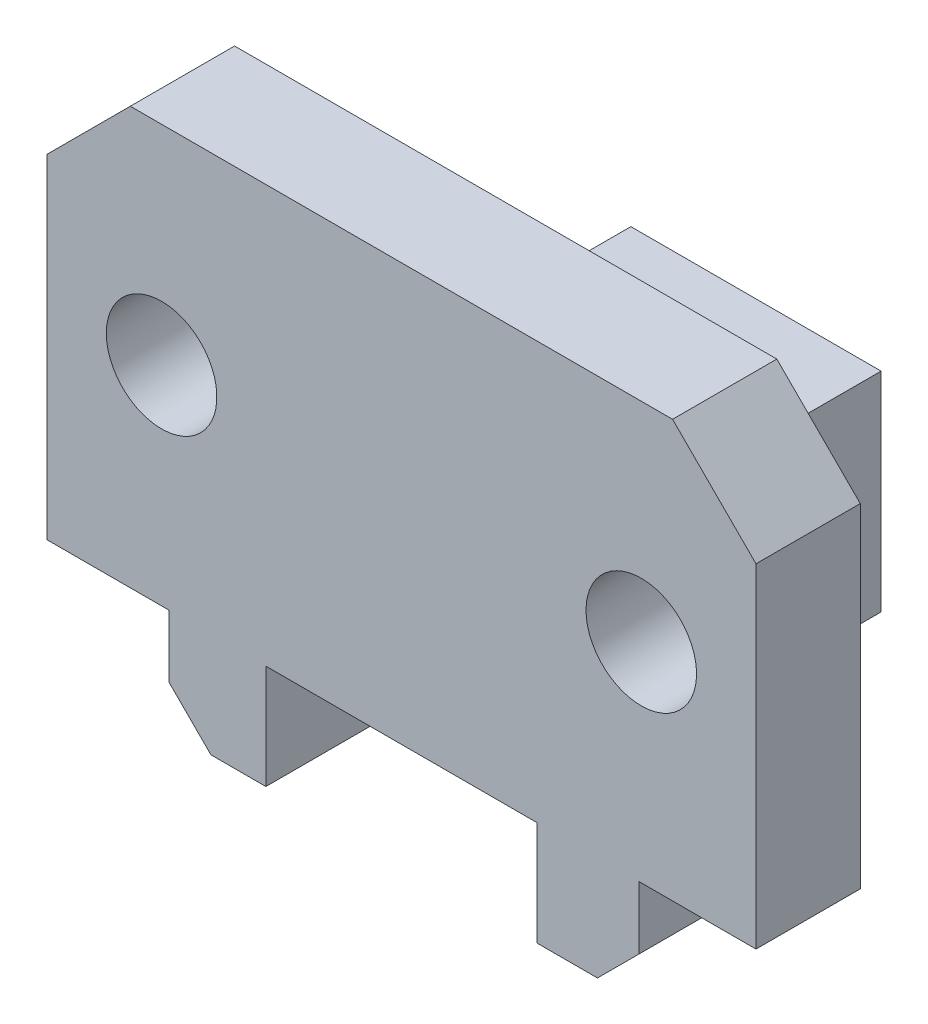
ISO-10303-21;
HEADER;
FILE_DESCRIPTION(('STEP AP214'),'2;1');
FILE_NAME('part.step','',(''),(''),'','','');
FILE_SCHEMA(('AUTOMOTIVE_DESIGN { 1 0 10303 214 1 1 1 1 }'));
ENDSEC;
DATA;
#1=APPLICATION_CONTEXT('core data for automotive mechanical design processes');
#2=APPLICATION_PROTOCOL_DEFINITION('international standard','automotive_design',2000,#1);
#3=PRODUCT_CONTEXT('',#1,'mechanical');
#4=PRODUCT('Part','Part','',(#3));
#5=PRODUCT_RELATED_PRODUCT_CATEGORY('part','',(#4));
#6=PRODUCT_DEFINITION_FORMATION('','',#4);
#7=PRODUCT_DEFINITION_CONTEXT('part definition',#1,'design');
#8=PRODUCT_DEFINITION('design','',#6,#7);
#9=PRODUCT_DEFINITION_SHAPE('','',#8);
#10=(LENGTH_UNIT() NAMED_UNIT(*) SI_UNIT(.MILLI.,.METRE.));
#11=(NAMED_UNIT(*) PLANE_ANGLE_UNIT() SI_UNIT($,.RADIAN.));
#12=(NAMED_UNIT(*) SI_UNIT($,.STERADIAN.) SOLID_ANGLE_UNIT());
#13=UNCERTAINTY_MEASURE_WITH_UNIT(LENGTH_MEASURE(1.E-05),#10,'distance_accuracy_value','');
#14=(GEOMETRIC_REPRESENTATION_CONTEXT(3) GLOBAL_UNCERTAINTY_ASSIGNED_CONTEXT((#13)) GLOBAL_UNIT_ASSIGNED_CONTEXT((#10,
#11,#12)) REPRESENTATION_CONTEXT('',''));
#15=CARTESIAN_POINT('',(0.,0.,0.));
#16=DIRECTION('',(0.,0.,1.));
#17=DIRECTION('',(1.,0.,0.));
#18=AXIS2_PLACEMENT_3D('',#15,#16,#17);
#19=CARTESIAN_POINT('',(0.,170.000002533197,-12.5));
#20=DIRECTION('',(0.,-1.,0.));
#21=DIRECTION('',(-1.,0.,0.));
#22=AXIS2_PLACEMENT_3D('',#19,#20,#21);
#23=CYLINDRICAL_SURFACE('',#22,1.6);
#24=CARTESIAN_POINT('',(0.,160.000001266599,-12.5));
#25=DIRECTION('',(0.,1.,0.));
#26=DIRECTION('',(-1.,0.,0.));
#27=AXIS2_PLACEMENT_3D('',#24,#25,#26);
#28=CIRCLE('',#27,1.6);
#29=CARTESIAN_POINT('',(1.6,160.000001266599,-12.5));
#30=VERTEX_POINT('',#29);
#31=EDGE_CURVE('E370',#30,#30,#28,.T.);
#32=ORIENTED_EDGE('',*,*,#31,.T.);
#33=DIRECTION('',(0.,-1.,0.));
#34=VECTOR('',#33,1.);
#35=CARTESIAN_POINT('',(1.6,170.000002533197,-12.5));
#36=LINE('',#35,#34);
#37=CARTESIAN_POINT('',(1.6,150.,-12.5));
#38=VERTEX_POINT('',#37);
#39=EDGE_CURVE('E11',#30,#38,#36,.T.);
#40=ORIENTED_EDGE('',*,*,#39,.T.);
#41=CARTESIAN_POINT('',(0.,150.,-12.5));
#42=DIRECTION('',(0.,1.,0.));
#43=DIRECTION('',(-1.,0.,0.));
#44=AXIS2_PLACEMENT_3D('',#41,#42,#43);
#45=CIRCLE('',#44,1.6);
#46=EDGE_CURVE('E353',#38,#38,#45,.T.);
#47=ORIENTED_EDGE('',*,*,#46,.F.);
#48=ORIENTED_EDGE('',*,*,#39,.F.);
#49=EDGE_LOOP('',(#32,#40,#47,#48));
#50=FACE_BOUND('',#49,.T.);
#51=ADVANCED_FACE('F16',(#50),#23,.F.);
#52=CARTESIAN_POINT('',(6.00000008940697,170.000002533197,0.));
#53=DIRECTION('',(1.,0.,0.));
#54=DIRECTION('',(0.,1.,0.));
#55=AXIS2_PLACEMENT_3D('',#52,#53,#54);
#56=PLANE('',#55);
#57=DIRECTION('',(0.,1.,0.));
#58=VECTOR('',#57,1.);
#59=CARTESIAN_POINT('',(6.00000008940697,165.000001899898,-17.));
#60=LINE('',#59,#58);
#61=CARTESIAN_POINT('',(6.00000008940697,150.,-17.));
#62=VERTEX_POINT('',#61);
#63=CARTESIAN_POINT('',(6.00000008940697,160.000001266599,-17.));
#64=VERTEX_POINT('',#63);
#65=EDGE_CURVE('E300',#62,#64,#60,.T.);
#66=ORIENTED_EDGE('',*,*,#65,.T.);
#67=DIRECTION('',(0.,0.,1.));
#68=VECTOR('',#67,1.);
#69=CARTESIAN_POINT('',(6.00000008940697,160.000001266599,-2.5));
#70=LINE('',#69,#68);
#71=CARTESIAN_POINT('',(6.00000008940697,160.000001266599,-10.));
#72=VERTEX_POINT('',#71);
#73=EDGE_CURVE('E366',#64,#72,#70,.T.);
#74=ORIENTED_EDGE('',*,*,#73,.T.);
#75=DIRECTION('',(0.,-0.70710678118655,-0.707106781186545));
#76=VECTOR('',#75,1.);
#77=CARTESIAN_POINT('',(6.00000008940697,166.250001583248,-3.74999968335034));
#78=LINE('',#77,#76);
#79=CARTESIAN_POINT('',(6.00000008940697,165.000001266599,-5.));
#80=VERTEX_POINT('',#79);
#81=EDGE_CURVE('E205',#80,#72,#78,.T.);
#82=ORIENTED_EDGE('',*,*,#81,.F.);
#83=DIRECTION('',(0.,-1.,0.));
#84=VECTOR('',#83,1.);
#85=CARTESIAN_POINT('',(6.00000008940697,160.000001266599,-5.00000008940697));
#86=LINE('',#85,#84);
#87=CARTESIAN_POINT('',(6.00000008940697,150.,-5.00000008940697));
#88=VERTEX_POINT('',#87);
#89=EDGE_CURVE('E346',#80,#88,#86,.T.);
#90=ORIENTED_EDGE('',*,*,#89,.T.);
#91=DIRECTION('',(0.,0.,-1.));
#92=VECTOR('',#91,1.);
#93=CARTESIAN_POINT('',(6.00000008940697,150.,0.));
#94=LINE('',#93,#92);
#95=EDGE_CURVE('E280',#88,#62,#94,.T.);
#96=ORIENTED_EDGE('',*,*,#95,.T.);
#97=EDGE_LOOP('',(#66,#74,#82,#90,#96));
#98=FACE_BOUND('',#97,.T.);
#99=ADVANCED_FACE('F791',(#98),#56,.T.);
#100=CARTESIAN_POINT('',(-11.5,160.000001266599,-5.));
#101=DIRECTION('',(0.,0.,1.));
#102=DIRECTION('',(1.,0.,0.));
#103=AXIS2_PLACEMENT_3D('',#100,#101,#102);
#104=CYLINDRICAL_SURFACE('',#103,2.65);
#105=CARTESIAN_POINT('',(-11.5,160.000001266599,-5.));
#106=DIRECTION('',(0.,0.,1.));
#107=DIRECTION('',(1.,0.,0.));
#108=AXIS2_PLACEMENT_3D('',#105,#106,#107);
#109=CIRCLE('',#108,2.65);
#110=CARTESIAN_POINT('',(-14.15,160.000001266599,-5.));
#111=VERTEX_POINT('',#110);
#112=EDGE_CURVE('E326',#111,#111,#109,.T.);
#113=ORIENTED_EDGE('',*,*,#112,.F.);
#114=DIRECTION('',(0.,0.,1.));
#115=VECTOR('',#114,1.);
#116=CARTESIAN_POINT('',(-14.15,160.000001266599,-5.));
#117=LINE('',#116,#115);
#118=CARTESIAN_POINT('',(-14.15,160.000001266599,0.));
#119=VERTEX_POINT('',#118);
#120=EDGE_CURVE('E27',#111,#119,#117,.T.);
#121=ORIENTED_EDGE('',*,*,#120,.T.);
#122=CARTESIAN_POINT('',(-11.5,160.000001266599,0.));
#123=DIRECTION('',(0.,0.,-1.));
#124=DIRECTION('',(1.,0.,0.));
#125=AXIS2_PLACEMENT_3D('',#122,#123,#124);
#126=CIRCLE('',#125,2.65);
#127=EDGE_CURVE('E317',#119,#119,#126,.T.);
#128=ORIENTED_EDGE('',*,*,#127,.F.);
#129=ORIENTED_EDGE('',*,*,#120,.F.);
#130=EDGE_LOOP('',(#113,#121,#128,#129));
#131=FACE_BOUND('',#130,.T.);
#132=ADVANCED_FACE('F796',(#131),#104,.F.);
#133=CARTESIAN_POINT('',(11.500000089407,160.000001266599,-5.00000008940697));
#134=DIRECTION('',(0.,0.,1.));
#135=DIRECTION('',(1.,0.,0.));
#136=AXIS2_PLACEMENT_3D('',#133,#134,#135);
#137=CYLINDRICAL_SURFACE('',#136,2.65);
#138=CARTESIAN_POINT('',(11.500000089407,160.000001266599,-5.00000008940697));
#139=DIRECTION('',(0.,0.,1.));
#140=DIRECTION('',(1.,0.,0.));
#141=AXIS2_PLACEMENT_3D('',#138,#139,#140);
#142=CIRCLE('',#141,2.65);
#143=CARTESIAN_POINT('',(8.85000008940696,160.000001266599,-5.00000008940697));
#144=VERTEX_POINT('',#143);
#145=EDGE_CURVE('E322',#144,#144,#142,.T.);
#146=ORIENTED_EDGE('',*,*,#145,.F.);
#147=DIRECTION('',(0.,0.,1.));
#148=VECTOR('',#147,1.);
#149=CARTESIAN_POINT('',(8.85000008940696,160.000001266599,-5.00000008940697));
#150=LINE('',#149,#148);
#151=CARTESIAN_POINT('',(8.85000008940696,160.000001266599,0.));
#152=VERTEX_POINT('',#151);
#153=EDGE_CURVE('E367',#144,#152,#150,.T.);
#154=ORIENTED_EDGE('',*,*,#153,.T.);
#155=CARTESIAN_POINT('',(11.500000089407,160.000001266599,0.));
#156=DIRECTION('',(0.,0.,-1.));
#157=DIRECTION('',(1.,0.,0.));
#158=AXIS2_PLACEMENT_3D('',#155,#156,#157);
#159=CIRCLE('',#158,2.65);
#160=EDGE_CURVE('E321',#152,#152,#159,.T.);
#161=ORIENTED_EDGE('',*,*,#160,.F.);
#162=ORIENTED_EDGE('',*,*,#153,.F.);
#163=EDGE_LOOP('',(#146,#154,#161,#162));
#164=FACE_BOUND('',#163,.T.);
#165=ADVANCED_FACE('F823',(#164),#137,.F.);
#166=CARTESIAN_POINT('',(-6.,170.000002533197,0.));
#167=DIRECTION('',(0.,1.,0.));
#168=DIRECTION('',(1.,0.,0.));
#169=AXIS2_PLACEMENT_3D('',#166,#167,#168);
#170=PLANE('',#169);
#171=DIRECTION('',(0.,0.,-1.));
#172=VECTOR('',#171,1.);
#173=CARTESIAN_POINT('',(-13.,170.000002533197,-1.25));
#174=LINE('',#173,#172);
#175=CARTESIAN_POINT('',(-13.,170.000002533197,0.));
#176=VERTEX_POINT('',#175);
#177=CARTESIAN_POINT('',(-13.,170.000002533197,-5.));
#178=VERTEX_POINT('',#177);
#179=EDGE_CURVE('E296',#176,#178,#174,.T.);
#180=ORIENTED_EDGE('',*,*,#179,.F.);
#181=DIRECTION('',(-1.,0.,0.));
#182=VECTOR('',#181,1.);
#183=CARTESIAN_POINT('',(6.00000008940697,170.000002533197,0.));
#184=LINE('',#183,#182);
#185=CARTESIAN_POINT('',(13.0000001937151,170.000002533197,0.));
#186=VERTEX_POINT('',#185);
#187=EDGE_CURVE('E281',#186,#176,#184,.T.);
#188=ORIENTED_EDGE('',*,*,#187,.F.);
#189=DIRECTION('',(0.,0.,1.));
#190=VECTOR('',#189,1.);
#191=CARTESIAN_POINT('',(13.0000001937151,170.000002533197,10.));
#192=LINE('',#191,#190);
#193=CARTESIAN_POINT('',(13.0000001937151,170.000002533197,-5.));
#194=VERTEX_POINT('',#193);
#195=EDGE_CURVE('E308',#194,#186,#192,.T.);
#196=ORIENTED_EDGE('',*,*,#195,.F.);
#197=DIRECTION('',(-1.,0.,0.));
#198=VECTOR('',#197,1.);
#199=CARTESIAN_POINT('',(-6.,170.000002533197,-5.));
#200=LINE('',#199,#198);
#201=EDGE_CURVE('E414',#194,#178,#200,.T.);
#202=ORIENTED_EDGE('',*,*,#201,.T.);
#203=EDGE_LOOP('',(#180,#188,#196,#202));
#204=FACE_BOUND('',#203,.T.);
#205=ADVANCED_FACE('F515',(#204),#170,.T.);
#206=CARTESIAN_POINT('',(-6.,160.000001266599,-5.));
#207=DIRECTION('',(0.,-1.,0.));
#208=DIRECTION('',(0.,0.,-1.));
#209=AXIS2_PLACEMENT_3D('',#206,#207,#208);
#210=PLANE('',#209);
#211=ORIENTED_EDGE('',*,*,#31,.F.);
#212=EDGE_LOOP('',(#211));
#213=FACE_BOUND('',#212,.T.);
#214=DIRECTION('',(-1.,0.,0.));
#215=VECTOR('',#214,1.);
#216=CARTESIAN_POINT('',(-2.99999997764823,160.000001266599,-17.));
#217=LINE('',#216,#215);
#218=CARTESIAN_POINT('',(-6.,160.000001266599,-17.));
#219=VERTEX_POINT('',#218);
#220=EDGE_CURVE('E395',#64,#219,#217,.T.);
#221=ORIENTED_EDGE('',*,*,#220,.T.);
#222=DIRECTION('',(0.,0.,-1.));
#223=VECTOR('',#222,1.);
#224=CARTESIAN_POINT('',(-6.,160.000001266599,-2.5));
#225=LINE('',#224,#223);
#226=CARTESIAN_POINT('',(-6.,160.000001266599,-10.));
#227=VERTEX_POINT('',#226);
#228=EDGE_CURVE('E301',#227,#219,#225,.T.);
#229=ORIENTED_EDGE('',*,*,#228,.F.);
#230=DIRECTION('',(-1.,0.,0.));
#231=VECTOR('',#230,1.);
#232=CARTESIAN_POINT('',(-6.,160.000001266599,-10.));
#233=LINE('',#232,#231);
#234=EDGE_CURVE('E363',#72,#227,#233,.T.);
#235=ORIENTED_EDGE('',*,*,#234,.F.);
#236=ORIENTED_EDGE('',*,*,#73,.F.);
#237=EDGE_LOOP('',(#221,#229,#235,#236));
#238=FACE_BOUND('',#237,.T.);
#239=ADVANCED_FACE('F817',(#213,#238),#210,.F.);
#240=CARTESIAN_POINT('',(-6.,162.500001266599,-7.5));
#241=DIRECTION('',(0.,0.707106781186545,-0.70710678118655));
#242=DIRECTION('',(-1.,0.,0.));
#243=AXIS2_PLACEMENT_3D('',#240,#241,#242);
#244=PLANE('',#243);
#245=DIRECTION('',(0.,0.70710678118655,0.707106781186545));
#246=VECTOR('',#245,1.);
#247=CARTESIAN_POINT('',(-6.,161.250000949949,-8.75000031664971));
#248=LINE('',#247,#246);
#249=CARTESIAN_POINT('',(-6.,165.000001266599,-5.));
#250=VERTEX_POINT('',#249);
#251=EDGE_CURVE('E197',#227,#250,#248,.T.);
#252=ORIENTED_EDGE('',*,*,#251,.T.);
#253=DIRECTION('',(1.,0.,0.));
#254=VECTOR('',#253,1.);
#255=CARTESIAN_POINT('',(-6.,165.000001266599,-5.));
#256=LINE('',#255,#254);
#257=EDGE_CURVE('E242',#250,#80,#256,.T.);
#258=ORIENTED_EDGE('',*,*,#257,.T.);
#259=ORIENTED_EDGE('',*,*,#81,.T.);
#260=ORIENTED_EDGE('',*,*,#234,.T.);
#261=EDGE_LOOP('',(#252,#258,#259,#260));
#262=FACE_BOUND('',#261,.T.);
#263=ADVANCED_FACE('F814',(#262),#244,.T.);
#264=CARTESIAN_POINT('',(-6.,150.,0.));
#265=DIRECTION('',(-1.,0.,0.));
#266=DIRECTION('',(0.,0.,1.));
#267=AXIS2_PLACEMENT_3D('',#264,#265,#266);
#268=PLANE('',#267);
#269=DIRECTION('',(0.,-1.,0.));
#270=VECTOR('',#269,1.);
#271=CARTESIAN_POINT('',(-6.,155.000000633299,-17.));
#272=LINE('',#271,#270);
#273=CARTESIAN_POINT('',(-6.,150.,-17.));
#274=VERTEX_POINT('',#273);
#275=EDGE_CURVE('E250',#219,#274,#272,.T.);
#276=ORIENTED_EDGE('',*,*,#275,.T.);
#277=DIRECTION('',(0.,0.,-1.));
#278=VECTOR('',#277,1.);
#279=CARTESIAN_POINT('',(-6.,150.,0.));
#280=LINE('',#279,#278);
#281=CARTESIAN_POINT('',(-6.,150.,-5.));
#282=VERTEX_POINT('',#281);
#283=EDGE_CURVE('E248',#282,#274,#280,.T.);
#284=ORIENTED_EDGE('',*,*,#283,.F.);
#285=DIRECTION('',(0.,1.,0.));
#286=VECTOR('',#285,1.);
#287=CARTESIAN_POINT('',(-6.,160.000001266599,-5.));
#288=LINE('',#287,#286);
#289=EDGE_CURVE('E233',#282,#250,#288,.T.);
#290=ORIENTED_EDGE('',*,*,#289,.T.);
#291=ORIENTED_EDGE('',*,*,#251,.F.);
#292=ORIENTED_EDGE('',*,*,#228,.T.);
#293=EDGE_LOOP('',(#276,#284,#290,#291,#292));
#294=FACE_BOUND('',#293,.T.);
#295=ADVANCED_FACE('F18',(#294),#268,.T.);
#296=CARTESIAN_POINT('',(4.47035009010222E-08,160.000001266599,-17.));
#297=DIRECTION('',(0.,0.,1.));
#298=DIRECTION('',(1.,0.,0.));
#299=AXIS2_PLACEMENT_3D('',#296,#297,#298);
#300=PLANE('',#299);
#301=ORIENTED_EDGE('',*,*,#220,.F.);
#302=ORIENTED_EDGE('',*,*,#65,.F.);
#303=DIRECTION('',(1.,0.,0.));
#304=VECTOR('',#303,1.);
#305=CARTESIAN_POINT('',(3.00000006705523,150.,-17.));
#306=LINE('',#305,#304);
#307=EDGE_CURVE('E255',#274,#62,#306,.T.);
#308=ORIENTED_EDGE('',*,*,#307,.F.);
#309=ORIENTED_EDGE('',*,*,#275,.F.);
#310=EDGE_LOOP('',(#301,#302,#308,#309));
#311=FACE_BOUND('',#310,.T.);
#312=ADVANCED_FACE('F805',(#311),#300,.F.);
#313=CARTESIAN_POINT('',(6.00000008940697,150.,0.));
#314=DIRECTION('',(0.,-1.,0.));
#315=DIRECTION('',(0.,0.,-1.));
#316=AXIS2_PLACEMENT_3D('',#313,#314,#315);
#317=PLANE('',#316);
#318=DIRECTION('',(1.,0.,0.));
#319=VECTOR('',#318,1.);
#320=CARTESIAN_POINT('',(-5.74999997764823,150.,0.));
#321=LINE('',#320,#319);
#322=CARTESIAN_POINT('',(-17.,150.,0.));
#323=VERTEX_POINT('',#322);
#324=CARTESIAN_POINT('',(-11.135,150.,0.));
#325=VERTEX_POINT('',#324);
#326=EDGE_CURVE('E272',#323,#325,#321,.T.);
#327=ORIENTED_EDGE('',*,*,#326,.F.);
#328=DIRECTION('',(0.,0.,1.));
#329=VECTOR('',#328,1.);
#330=CARTESIAN_POINT('',(-17.,150.,-1.25));
#331=LINE('',#330,#329);
#332=CARTESIAN_POINT('',(-17.,150.,-5.));
#333=VERTEX_POINT('',#332);
#334=EDGE_CURVE('E357',#333,#323,#331,.T.);
#335=ORIENTED_EDGE('',*,*,#334,.F.);
#336=DIRECTION('',(-1.,0.,0.));
#337=VECTOR('',#336,1.);
#338=CARTESIAN_POINT('',(-3.000124314121,150.,-5.));
#339=LINE('',#338,#337);
#340=CARTESIAN_POINT('',(-11.135,150.,-5.));
#341=VERTEX_POINT('',#340);
#342=EDGE_CURVE('E411',#341,#333,#339,.T.);
#343=ORIENTED_EDGE('',*,*,#342,.F.);
#344=DIRECTION('',(0.,0.,1.));
#345=VECTOR('',#344,1.);
#346=CARTESIAN_POINT('',(-11.135,150.,0.));
#347=LINE('',#346,#345);
#348=EDGE_CURVE('E271',#341,#325,#347,.T.);
#349=ORIENTED_EDGE('',*,*,#348,.T.);
#350=EDGE_LOOP('',(#327,#335,#343,#349));
#351=FACE_BOUND('',#350,.T.);
#352=ADVANCED_FACE('F774',(#351),#317,.T.);
#353=CARTESIAN_POINT('',(6.00000008940697,150.,0.));
#354=DIRECTION('',(0.,-1.,0.));
#355=DIRECTION('',(0.,0.,-1.));
#356=AXIS2_PLACEMENT_3D('',#353,#354,#355);
#357=PLANE('',#356);
#358=DIRECTION('',(-1.,0.,0.));
#359=VECTOR('',#358,1.);
#360=CARTESIAN_POINT('',(2.80000008568169,150.,-5.));
#361=LINE('',#360,#359);
#362=CARTESIAN_POINT('',(17.0000001937151,150.000002235174,-5.00000008940697));
#363=VERTEX_POINT('',#362);
#364=CARTESIAN_POINT('',(11.4000001713634,150.,-5.));
#365=VERTEX_POINT('',#364);
#366=EDGE_CURVE('E332',#363,#365,#361,.T.);
#367=ORIENTED_EDGE('',*,*,#366,.F.);
#368=DIRECTION('',(0.,0.,-1.));
#369=VECTOR('',#368,1.);
#370=CARTESIAN_POINT('',(17.0000001937151,150.000002235174,7.49999995529652));
#371=LINE('',#370,#369);
#372=CARTESIAN_POINT('',(17.0000001937151,150.,0.));
#373=VERTEX_POINT('',#372);
#374=EDGE_CURVE('E311',#373,#363,#371,.T.);
#375=ORIENTED_EDGE('',*,*,#374,.F.);
#376=DIRECTION('',(1.,0.,0.));
#377=VECTOR('',#376,1.);
#378=CARTESIAN_POINT('',(6.00000008940697,150.,0.));
#379=LINE('',#378,#377);
#380=CARTESIAN_POINT('',(11.4000001713634,150.,0.));
#381=VERTEX_POINT('',#380);
#382=EDGE_CURVE('E340',#381,#373,#379,.T.);
#383=ORIENTED_EDGE('',*,*,#382,.F.);
#384=DIRECTION('',(0.,0.,-1.));
#385=VECTOR('',#384,1.);
#386=CARTESIAN_POINT('',(11.4000001713634,150.,-2.5));
#387=LINE('',#386,#385);
#388=EDGE_CURVE('E313',#381,#365,#387,.T.);
#389=ORIENTED_EDGE('',*,*,#388,.T.);
#390=EDGE_LOOP('',(#367,#375,#383,#389));
#391=FACE_BOUND('',#390,.T.);
#392=ADVANCED_FACE('F498',(#391),#357,.T.);
#393=CARTESIAN_POINT('',(-11.135,150.,0.));
#394=DIRECTION('',(1.,0.,0.));
#395=DIRECTION('',(0.,1.,0.));
#396=AXIS2_PLACEMENT_3D('',#393,#394,#395);
#397=PLANE('',#396);
#398=DIRECTION('',(0.,0.,-1.));
#399=VECTOR('',#398,1.);
#400=CARTESIAN_POINT('',(-11.135,147.,-1.25));
#401=LINE('',#400,#399);
#402=CARTESIAN_POINT('',(-11.135,147.,0.));
#403=VERTEX_POINT('',#402);
#404=CARTESIAN_POINT('',(-11.135,147.,-5.));
#405=VERTEX_POINT('',#404);
#406=EDGE_CURVE('E390',#403,#405,#401,.T.);
#407=ORIENTED_EDGE('',*,*,#406,.F.);
#408=DIRECTION('',(0.,-1.,0.));
#409=VECTOR('',#408,1.);
#410=CARTESIAN_POINT('',(-11.135,155.000000633299,0.));
#411=LINE('',#410,#409);
#412=EDGE_CURVE('E275',#325,#403,#411,.T.);
#413=ORIENTED_EDGE('',*,*,#412,.F.);
#414=ORIENTED_EDGE('',*,*,#348,.F.);
#415=DIRECTION('',(0.,1.,0.));
#416=VECTOR('',#415,1.);
#417=CARTESIAN_POINT('',(-11.135,160.000001266599,-5.));
#418=LINE('',#417,#416);
#419=EDGE_CURVE('E415',#405,#341,#418,.T.);
#420=ORIENTED_EDGE('',*,*,#419,.F.);
#421=EDGE_LOOP('',(#407,#413,#414,#420));
#422=FACE_BOUND('',#421,.T.);
#423=ADVANCED_FACE('F770',(#422),#397,.F.);
#424=CARTESIAN_POINT('',(11.4000001713634,150.,-5.));
#425=DIRECTION('',(-1.,0.,0.));
#426=DIRECTION('',(0.,0.,1.));
#427=AXIS2_PLACEMENT_3D('',#424,#425,#426);
#428=PLANE('',#427);
#429=DIRECTION('',(0.,0.,1.));
#430=VECTOR('',#429,1.);
#431=CARTESIAN_POINT('',(11.4000001713634,147.,-3.75));
#432=LINE('',#431,#430);
#433=CARTESIAN_POINT('',(11.4000001713634,147.,-5.));
#434=VERTEX_POINT('',#433);
#435=CARTESIAN_POINT('',(11.4000001713634,147.,0.));
#436=VERTEX_POINT('',#435);
#437=EDGE_CURVE('E316',#434,#436,#432,.T.);
#438=ORIENTED_EDGE('',*,*,#437,.F.);
#439=DIRECTION('',(0.,-1.,0.));
#440=VECTOR('',#439,1.);
#441=CARTESIAN_POINT('',(11.4000001713634,160.000001266599,-5.));
#442=LINE('',#441,#440);
#443=EDGE_CURVE('E327',#365,#434,#442,.T.);
#444=ORIENTED_EDGE('',*,*,#443,.F.);
#445=ORIENTED_EDGE('',*,*,#388,.F.);
#446=DIRECTION('',(0.,1.,0.));
#447=VECTOR('',#446,1.);
#448=CARTESIAN_POINT('',(11.4000001713634,155.000000633299,0.));
#449=LINE('',#448,#447);
#450=EDGE_CURVE('E336',#436,#381,#449,.T.);
#451=ORIENTED_EDGE('',*,*,#450,.F.);
#452=EDGE_LOOP('',(#438,#444,#445,#451));
#453=FACE_BOUND('',#452,.T.);
#454=ADVANCED_FACE('F483',(#453),#428,.F.);
#455=CARTESIAN_POINT('',(10.4000001713634,146.,-3.75));
#456=DIRECTION('',(0.707106781186546,-0.707106781186549,0.));
#457=DIRECTION('',(0.,0.,-1.));
#458=AXIS2_PLACEMENT_3D('',#455,#456,#457);
#459=PLANE('',#458);
#460=DIRECTION('',(-0.707106781186549,-0.707106781186546,0.));
#461=VECTOR('',#460,1.);
#462=CARTESIAN_POINT('',(11.3000004563481,146.900000284985,0.));
#463=LINE('',#462,#461);
#464=CARTESIAN_POINT('',(9.40000017136335,145.,0.));
#465=VERTEX_POINT('',#464);
#466=EDGE_CURVE('E341',#436,#465,#463,.T.);
#467=ORIENTED_EDGE('',*,*,#466,.T.);
#468=DIRECTION('',(0.,0.,-1.));
#469=VECTOR('',#468,1.);
#470=CARTESIAN_POINT('',(9.40000017136335,145.,-3.75));
#471=LINE('',#470,#469);
#472=CARTESIAN_POINT('',(9.40000017136336,145.,-5.));
#473=VERTEX_POINT('',#472);
#474=EDGE_CURVE('E352',#465,#473,#471,.T.);
#475=ORIENTED_EDGE('',*,*,#474,.T.);
#476=DIRECTION('',(0.707106781186549,0.707106781186546,0.));
#477=VECTOR('',#476,1.);
#478=CARTESIAN_POINT('',(12.3000007618219,147.900000590458,-5.));
#479=LINE('',#478,#477);
#480=EDGE_CURVE('E331',#473,#434,#479,.T.);
#481=ORIENTED_EDGE('',*,*,#480,.T.);
#482=ORIENTED_EDGE('',*,*,#437,.T.);
#483=EDGE_LOOP('',(#467,#475,#481,#482));
#484=FACE_BOUND('',#483,.T.);
#485=ADVANCED_FACE('F478',(#484),#459,.T.);
#486=CARTESIAN_POINT('',(-10.135,146.,-1.25));
#487=DIRECTION('',(-0.707106781186546,-0.707106781186549,0.));
#488=DIRECTION('',(-0.707106781186549,0.707106781186546,0.));
#489=AXIS2_PLACEMENT_3D('',#486,#487,#488);
#490=PLANE('',#489);
#491=DIRECTION('',(0.707106781186549,-0.707106781186546,0.));
#492=VECTOR('',#491,1.);
#493=CARTESIAN_POINT('',(-15.1012506332993,150.966250633299,-5.));
#494=LINE('',#493,#492);
#495=CARTESIAN_POINT('',(-9.135,145.,-5.));
#496=VERTEX_POINT('',#495);
#497=EDGE_CURVE('E245',#405,#496,#494,.T.);
#498=ORIENTED_EDGE('',*,*,#497,.T.);
#499=DIRECTION('',(0.,0.,1.));
#500=VECTOR('',#499,1.);
#501=CARTESIAN_POINT('',(-9.135,145.,-1.25));
#502=LINE('',#501,#500);
#503=CARTESIAN_POINT('',(-9.135,145.,0.));
#504=VERTEX_POINT('',#503);
#505=EDGE_CURVE('E406',#496,#504,#502,.T.);
#506=ORIENTED_EDGE('',*,*,#505,.T.);
#507=DIRECTION('',(-0.707106781186549,0.707106781186546,0.));
#508=VECTOR('',#507,1.);
#509=CARTESIAN_POINT('',(-11.1012503054738,146.966250305474,0.));
#510=LINE('',#509,#508);
#511=EDGE_CURVE('E292',#504,#403,#510,.T.);
#512=ORIENTED_EDGE('',*,*,#511,.T.);
#513=ORIENTED_EDGE('',*,*,#406,.T.);
#514=EDGE_LOOP('',(#498,#506,#512,#513));
#515=FACE_BOUND('',#514,.T.);
#516=ADVANCED_FACE('F765',(#515),#490,.T.);
#517=CARTESIAN_POINT('',(17.0000001937151,150.000002235174,20.));
#518=DIRECTION('',(1.,0.,0.));
#519=DIRECTION('',(0.,1.,0.));
#520=AXIS2_PLACEMENT_3D('',#517,#518,#519);
#521=PLANE('',#520);
#522=DIRECTION('',(0.,0.,-1.));
#523=VECTOR('',#522,1.);
#524=CARTESIAN_POINT('',(17.0000001937151,166.000002533197,10.));
#525=LINE('',#524,#523);
#526=CARTESIAN_POINT('',(17.000000089407,166.000002533197,0.));
#527=VERTEX_POINT('',#526);
#528=CARTESIAN_POINT('',(17.000000089407,166.000002533197,-5.00000008940697));
#529=VERTEX_POINT('',#528);
#530=EDGE_CURVE('E312',#527,#529,#525,.T.);
#531=ORIENTED_EDGE('',*,*,#530,.F.);
#532=DIRECTION('',(0.,-1.,0.));
#533=VECTOR('',#532,1.);
#534=CARTESIAN_POINT('',(17.000000089407,150.,0.));
#535=LINE('',#534,#533);
#536=EDGE_CURVE('E381',#527,#373,#535,.T.);
#537=ORIENTED_EDGE('',*,*,#536,.T.);
#538=ORIENTED_EDGE('',*,*,#374,.T.);
#539=DIRECTION('',(0.,1.,0.));
#540=VECTOR('',#539,1.);
#541=CARTESIAN_POINT('',(17.000000089407,155.000000633299,-5.00000008940697));
#542=LINE('',#541,#540);
#543=EDGE_CURVE('E449',#363,#529,#542,.T.);
#544=ORIENTED_EDGE('',*,*,#543,.T.);
#545=EDGE_LOOP('',(#531,#537,#538,#544));
#546=FACE_BOUND('',#545,.T.);
#547=ADVANCED_FACE('F502',(#546),#521,.T.);
#548=CARTESIAN_POINT('',(15.0000001937151,168.000002533197,10.));
#549=DIRECTION('',(0.707106781186546,0.707106781186549,0.));
#550=DIRECTION('',(0.,0.,-1.));
#551=AXIS2_PLACEMENT_3D('',#548,#549,#550);
#552=PLANE('',#551);
#553=DIRECTION('',(0.707106781186549,-0.707106781186546,0.));
#554=VECTOR('',#553,1.);
#555=CARTESIAN_POINT('',(13.2500004731119,169.750002253801,0.));
#556=LINE('',#555,#554);
#557=EDGE_CURVE('E286',#186,#527,#556,.T.);
#558=ORIENTED_EDGE('',*,*,#557,.T.);
#559=ORIENTED_EDGE('',*,*,#530,.T.);
#560=DIRECTION('',(-0.707106781186549,0.707106781186546,0.));
#561=VECTOR('',#560,1.);
#562=CARTESIAN_POINT('',(9.25000014528631,173.750002581626,-5.));
#563=LINE('',#562,#561);
#564=EDGE_CURVE('E20',#529,#194,#563,.T.);
#565=ORIENTED_EDGE('',*,*,#564,.T.);
#566=ORIENTED_EDGE('',*,*,#195,.T.);
#567=EDGE_LOOP('',(#558,#559,#565,#566));
#568=FACE_BOUND('',#567,.T.);
#569=ADVANCED_FACE('F511',(#568),#552,.T.);
#570=CARTESIAN_POINT('',(-6.,170.000002533197,-5.));
#571=DIRECTION('',(0.,0.,-1.));
#572=DIRECTION('',(0.,-1.,0.));
#573=AXIS2_PLACEMENT_3D('',#570,#571,#572);
#574=PLANE('',#573);
#575=ORIENTED_EDGE('',*,*,#145,.T.);
#576=EDGE_LOOP('',(#575));
#577=FACE_BOUND('',#576,.T.);
#578=ORIENTED_EDGE('',*,*,#112,.T.);
#579=EDGE_LOOP('',(#578));
#580=FACE_BOUND('',#579,.T.);
#581=DIRECTION('',(-1.,0.,0.));
#582=VECTOR('',#581,1.);
#583=CARTESIAN_POINT('',(5.21540810538568E-08,150.,-5.));
#584=LINE('',#583,#582);
#585=CARTESIAN_POINT('',(6.50000008940697,150.,-5.00000008940697));
#586=VERTEX_POINT('',#585);
#587=EDGE_CURVE('E377',#586,#88,#584,.T.);
#588=ORIENTED_EDGE('',*,*,#587,.T.);
#589=ORIENTED_EDGE('',*,*,#89,.F.);
#590=ORIENTED_EDGE('',*,*,#257,.F.);
#591=ORIENTED_EDGE('',*,*,#289,.F.);
#592=DIRECTION('',(-1.,0.,0.));
#593=VECTOR('',#592,1.);
#594=CARTESIAN_POINT('',(-6.00000004470347,150.000002235174,-5.));
#595=LINE('',#594,#593);
#596=CARTESIAN_POINT('',(-6.5,150.,-5.));
#597=VERTEX_POINT('',#596);
#598=EDGE_CURVE('E239',#282,#597,#595,.T.);
#599=ORIENTED_EDGE('',*,*,#598,.T.);
#600=DIRECTION('',(0.,-1.,0.));
#601=VECTOR('',#600,1.);
#602=CARTESIAN_POINT('',(-6.5,157.500001266599,-5.));
#603=LINE('',#602,#601);
#604=CARTESIAN_POINT('',(-6.50000008940697,145.,-5.));
#605=VERTEX_POINT('',#604);
#606=EDGE_CURVE('E459',#597,#605,#603,.T.);
#607=ORIENTED_EDGE('',*,*,#606,.T.);
#608=DIRECTION('',(1.,0.,0.));
#609=VECTOR('',#608,1.);
#610=CARTESIAN_POINT('',(-11.5,145.,-5.));
#611=LINE('',#610,#609);
#612=EDGE_CURVE('E419',#496,#605,#611,.T.);
#613=ORIENTED_EDGE('',*,*,#612,.F.);
#614=ORIENTED_EDGE('',*,*,#497,.F.);
#615=ORIENTED_EDGE('',*,*,#419,.T.);
#616=ORIENTED_EDGE('',*,*,#342,.T.);
#617=DIRECTION('',(0.,-1.,0.));
#618=VECTOR('',#617,1.);
#619=CARTESIAN_POINT('',(-17.,150.,-5.));
#620=LINE('',#619,#618);
#621=CARTESIAN_POINT('',(-17.,166.000002533197,-5.));
#622=VERTEX_POINT('',#621);
#623=EDGE_CURVE('E307',#622,#333,#620,.T.);
#624=ORIENTED_EDGE('',*,*,#623,.F.);
#625=DIRECTION('',(-0.707106781186549,-0.707106781186546,0.));
#626=VECTOR('',#625,1.);
#627=CARTESIAN_POINT('',(-12.25,170.750002533197,-5.));
#628=LINE('',#627,#626);
#629=EDGE_CURVE('E297',#178,#622,#628,.T.);
#630=ORIENTED_EDGE('',*,*,#629,.F.);
#631=ORIENTED_EDGE('',*,*,#201,.F.);
#632=ORIENTED_EDGE('',*,*,#564,.F.);
#633=ORIENTED_EDGE('',*,*,#543,.F.);
#634=ORIENTED_EDGE('',*,*,#366,.T.);
#635=ORIENTED_EDGE('',*,*,#443,.T.);
#636=ORIENTED_EDGE('',*,*,#480,.F.);
#637=DIRECTION('',(1.,0.,0.));
#638=VECTOR('',#637,1.);
#639=CARTESIAN_POINT('',(-11.5,145.,-5.));
#640=LINE('',#639,#638);
#641=CARTESIAN_POINT('',(6.50000010430813,145.,-5.));
#642=VERTEX_POINT('',#641);
#643=EDGE_CURVE('E348',#642,#473,#640,.T.);
#644=ORIENTED_EDGE('',*,*,#643,.F.);
#645=DIRECTION('',(0.,1.,0.));
#646=VECTOR('',#645,1.);
#647=CARTESIAN_POINT('',(6.50000008940697,160.000002384186,-5.));
#648=LINE('',#647,#646);
#649=EDGE_CURVE('E445',#642,#586,#648,.T.);
#650=ORIENTED_EDGE('',*,*,#649,.T.);
#651=EDGE_LOOP('',(#588,#589,#590,#591,#599,#607,#613,#614,#615,#616,#624,#630,#631,#632,#633,
#634,#635,#636,#644,#650));
#652=FACE_BOUND('',#651,.T.);
#653=ADVANCED_FACE('F236',(#577,#580,#652),#574,.T.);
#654=CARTESIAN_POINT('',(-17.,160.000001266599,-2.5));
#655=DIRECTION('',(-1.,0.,0.));
#656=DIRECTION('',(0.,0.,1.));
#657=AXIS2_PLACEMENT_3D('',#654,#655,#656);
#658=PLANE('',#657);
#659=DIRECTION('',(0.,0.,1.));
#660=VECTOR('',#659,1.);
#661=CARTESIAN_POINT('',(-17.,166.000002533197,-1.25));
#662=LINE('',#661,#660);
#663=CARTESIAN_POINT('',(-17.,166.000002533197,0.));
#664=VERTEX_POINT('',#663);
#665=EDGE_CURVE('E293',#622,#664,#662,.T.);
#666=ORIENTED_EDGE('',*,*,#665,.F.);
#667=ORIENTED_EDGE('',*,*,#623,.T.);
#668=ORIENTED_EDGE('',*,*,#334,.T.);
#669=DIRECTION('',(0.,-1.,0.));
#670=VECTOR('',#669,1.);
#671=CARTESIAN_POINT('',(-17.,150.,0.));
#672=LINE('',#671,#670);
#673=EDGE_CURVE('E276',#664,#323,#672,.T.);
#674=ORIENTED_EDGE('',*,*,#673,.F.);
#675=EDGE_LOOP('',(#666,#667,#668,#674));
#676=FACE_BOUND('',#675,.T.);
#677=ADVANCED_FACE('F776',(#676),#658,.T.);
#678=CARTESIAN_POINT('',(-15.,168.000002533197,-1.25));
#679=DIRECTION('',(-0.707106781186546,0.707106781186549,0.));
#680=DIRECTION('',(0.,0.,1.));
#681=AXIS2_PLACEMENT_3D('',#678,#679,#680);
#682=PLANE('',#681);
#683=ORIENTED_EDGE('',*,*,#629,.T.);
#684=ORIENTED_EDGE('',*,*,#665,.T.);
#685=DIRECTION('',(0.707106781186549,0.707106781186546,0.));
#686=VECTOR('',#685,1.);
#687=CARTESIAN_POINT('',(-13.2500003054738,169.750002227724,0.));
#688=LINE('',#687,#686);
#689=EDGE_CURVE('E285',#664,#176,#688,.T.);
#690=ORIENTED_EDGE('',*,*,#689,.T.);
#691=ORIENTED_EDGE('',*,*,#179,.T.);
#692=EDGE_LOOP('',(#683,#684,#690,#691));
#693=FACE_BOUND('',#692,.T.);
#694=ADVANCED_FACE('F519',(#693),#682,.T.);
#695=CARTESIAN_POINT('',(8.56816928518356E-08,145.,-2.5));
#696=DIRECTION('',(0.,-1.,0.));
#697=DIRECTION('',(0.,0.,-1.));
#698=AXIS2_PLACEMENT_3D('',#695,#696,#697);
#699=PLANE('',#698);
#700=DIRECTION('',(0.,0.,1.));
#701=VECTOR('',#700,1.);
#702=CARTESIAN_POINT('',(-6.5,145.,-1.25));
#703=LINE('',#702,#701);
#704=CARTESIAN_POINT('',(-6.50000008940697,145.,0.));
#705=VERTEX_POINT('',#704);
#706=EDGE_CURVE('E262',#605,#705,#703,.T.);
#707=ORIENTED_EDGE('',*,*,#706,.T.);
#708=DIRECTION('',(1.,0.,0.));
#709=VECTOR('',#708,1.);
#710=CARTESIAN_POINT('',(11.5000001713634,145.,0.));
#711=LINE('',#710,#709);
#712=EDGE_CURVE('E287',#504,#705,#711,.T.);
#713=ORIENTED_EDGE('',*,*,#712,.F.);
#714=ORIENTED_EDGE('',*,*,#505,.F.);
#715=ORIENTED_EDGE('',*,*,#612,.T.);
#716=EDGE_LOOP('',(#707,#713,#714,#715));
#717=FACE_BOUND('',#716,.T.);
#718=ADVANCED_FACE('F762',(#717),#699,.T.);
#719=CARTESIAN_POINT('',(8.56816928518356E-08,145.,-2.5));
#720=DIRECTION('',(0.,-1.,0.));
#721=DIRECTION('',(0.,0.,-1.));
#722=AXIS2_PLACEMENT_3D('',#719,#720,#721);
#723=PLANE('',#722);
#724=DIRECTION('',(0.,0.,-1.));
#725=VECTOR('',#724,1.);
#726=CARTESIAN_POINT('',(6.50000008940697,145.,-1.25));
#727=LINE('',#726,#725);
#728=CARTESIAN_POINT('',(6.50000010430813,145.,0.));
#729=VERTEX_POINT('',#728);
#730=EDGE_CURVE('E441',#729,#642,#727,.T.);
#731=ORIENTED_EDGE('',*,*,#730,.T.);
#732=ORIENTED_EDGE('',*,*,#643,.T.);
#733=ORIENTED_EDGE('',*,*,#474,.F.);
#734=DIRECTION('',(1.,0.,0.));
#735=VECTOR('',#734,1.);
#736=CARTESIAN_POINT('',(11.5000001713634,145.,0.));
#737=LINE('',#736,#735);
#738=EDGE_CURVE('E361',#729,#465,#737,.T.);
#739=ORIENTED_EDGE('',*,*,#738,.F.);
#740=EDGE_LOOP('',(#731,#732,#733,#739));
#741=FACE_BOUND('',#740,.T.);
#742=ADVANCED_FACE('F490',(#741),#723,.T.);
#743=CARTESIAN_POINT('',(6.00000008940697,150.,0.));
#744=DIRECTION('',(0.,-1.,0.));
#745=DIRECTION('',(0.,0.,-1.));
#746=AXIS2_PLACEMENT_3D('',#743,#744,#745);
#747=PLANE('',#746);
#748=ORIENTED_EDGE('',*,*,#46,.T.);
#749=EDGE_LOOP('',(#748));
#750=FACE_BOUND('',#749,.T.);
#751=DIRECTION('',(1.,0.,0.));
#752=VECTOR('',#751,1.);
#753=CARTESIAN_POINT('',(3.00000007450581,150.,0.));
#754=LINE('',#753,#752);
#755=CARTESIAN_POINT('',(-6.50000008940697,150.000002235174,0.));
#756=VERTEX_POINT('',#755);
#757=CARTESIAN_POINT('',(6.50000010430813,150.000002235174,0.));
#758=VERTEX_POINT('',#757);
#759=EDGE_CURVE('E358',#756,#758,#754,.T.);
#760=ORIENTED_EDGE('',*,*,#759,.F.);
#761=DIRECTION('',(0.,0.,-1.));
#762=VECTOR('',#761,1.);
#763=CARTESIAN_POINT('',(-6.50000008940697,150.000002235174,0.));
#764=LINE('',#763,#762);
#765=EDGE_CURVE('E259',#756,#597,#764,.T.);
#766=ORIENTED_EDGE('',*,*,#765,.T.);
#767=ORIENTED_EDGE('',*,*,#598,.F.);
#768=ORIENTED_EDGE('',*,*,#283,.T.);
#769=ORIENTED_EDGE('',*,*,#307,.T.);
#770=ORIENTED_EDGE('',*,*,#95,.F.);
#771=ORIENTED_EDGE('',*,*,#587,.F.);
#772=DIRECTION('',(0.,0.,1.));
#773=VECTOR('',#772,1.);
#774=CARTESIAN_POINT('',(6.50000010430813,150.,0.));
#775=LINE('',#774,#773);
#776=EDGE_CURVE('E362',#586,#758,#775,.T.);
#777=ORIENTED_EDGE('',*,*,#776,.T.);
#778=EDGE_LOOP('',(#760,#766,#767,#768,#769,#770,#771,#777));
#779=FACE_BOUND('',#778,.T.);
#780=ADVANCED_FACE('F258',(#750,#779),#747,.T.);
#781=CARTESIAN_POINT('',(-6.5,145.,0.));
#782=DIRECTION('',(-1.,0.,0.));
#783=DIRECTION('',(0.,0.,1.));
#784=AXIS2_PLACEMENT_3D('',#781,#782,#783);
#785=PLANE('',#784);
#786=ORIENTED_EDGE('',*,*,#606,.F.);
#787=ORIENTED_EDGE('',*,*,#765,.F.);
#788=DIRECTION('',(0.,1.,0.));
#789=VECTOR('',#788,1.);
#790=CARTESIAN_POINT('',(-6.5,152.500000633299,0.));
#791=LINE('',#790,#789);
#792=EDGE_CURVE('E291',#705,#756,#791,.T.);
#793=ORIENTED_EDGE('',*,*,#792,.F.);
#794=ORIENTED_EDGE('',*,*,#706,.F.);
#795=EDGE_LOOP('',(#786,#787,#793,#794));
#796=FACE_BOUND('',#795,.T.);
#797=ADVANCED_FACE('F758',(#796),#785,.F.);
#798=CARTESIAN_POINT('',(4.47035009010222E-08,160.000001266599,0.));
#799=DIRECTION('',(0.,0.,-1.));
#800=DIRECTION('',(0.,-1.,0.));
#801=AXIS2_PLACEMENT_3D('',#798,#799,#800);
#802=PLANE('',#801);
#803=ORIENTED_EDGE('',*,*,#160,.T.);
#804=EDGE_LOOP('',(#803));
#805=FACE_BOUND('',#804,.T.);
#806=ORIENTED_EDGE('',*,*,#127,.T.);
#807=EDGE_LOOP('',(#806));
#808=FACE_BOUND('',#807,.T.);
#809=ORIENTED_EDGE('',*,*,#759,.T.);
#810=DIRECTION('',(0.,-1.,0.));
#811=VECTOR('',#810,1.);
#812=CARTESIAN_POINT('',(6.50000008940697,155.000001750886,0.));
#813=LINE('',#812,#811);
#814=EDGE_CURVE('E438',#758,#729,#813,.T.);
#815=ORIENTED_EDGE('',*,*,#814,.T.);
#816=ORIENTED_EDGE('',*,*,#738,.T.);
#817=ORIENTED_EDGE('',*,*,#466,.F.);
#818=ORIENTED_EDGE('',*,*,#450,.T.);
#819=ORIENTED_EDGE('',*,*,#382,.T.);
#820=ORIENTED_EDGE('',*,*,#536,.F.);
#821=ORIENTED_EDGE('',*,*,#557,.F.);
#822=ORIENTED_EDGE('',*,*,#187,.T.);
#823=ORIENTED_EDGE('',*,*,#689,.F.);
#824=ORIENTED_EDGE('',*,*,#673,.T.);
#825=ORIENTED_EDGE('',*,*,#326,.T.);
#826=ORIENTED_EDGE('',*,*,#412,.T.);
#827=ORIENTED_EDGE('',*,*,#511,.F.);
#828=ORIENTED_EDGE('',*,*,#712,.T.);
#829=ORIENTED_EDGE('',*,*,#792,.T.);
#830=EDGE_LOOP('',(#809,#815,#816,#817,#818,#819,#820,#821,#822,#823,#824,#825,#826,#827,#828,#829));
#831=FACE_BOUND('',#830,.T.);
#832=ADVANCED_FACE('F486',(#805,#808,#831),#802,.F.);
#833=CARTESIAN_POINT('',(6.50000008940697,150.000002235174,0.));
#834=DIRECTION('',(1.,0.,0.));
#835=DIRECTION('',(0.,1.,0.));
#836=AXIS2_PLACEMENT_3D('',#833,#834,#835);
#837=PLANE('',#836);
#838=ORIENTED_EDGE('',*,*,#649,.F.);
#839=ORIENTED_EDGE('',*,*,#730,.F.);
#840=ORIENTED_EDGE('',*,*,#814,.F.);
#841=ORIENTED_EDGE('',*,*,#776,.F.);
#842=EDGE_LOOP('',(#838,#839,#840,#841));
#843=FACE_BOUND('',#842,.T.);
#844=ADVANCED_FACE('F780',(#843),#837,.F.);
#845=CLOSED_SHELL('',(#51,#99,#132,#165,#205,#239,#263,#295,#312,#352,#392,#423,#454,#485,#516,
#547,#569,#653,#677,#694,#718,#742,#780,#797,#832,#844));
#846=MANIFOLD_SOLID_BREP('B1',#845);
#847=ADVANCED_BREP_SHAPE_REPRESENTATION('',(#18,#846),#14);
#848=SHAPE_DEFINITION_REPRESENTATION(#9,#847);
ENDSEC;
END-ISO-10303-21;
